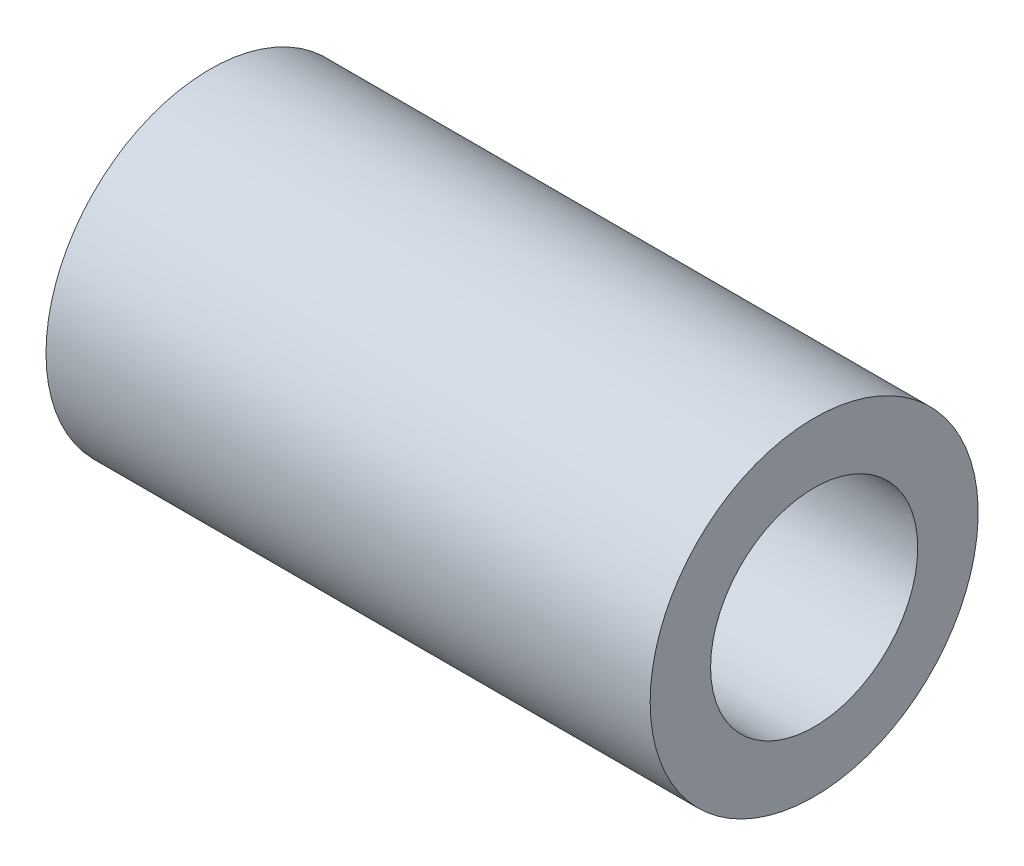
ISO-10303-21;
HEADER;
FILE_DESCRIPTION(('STEP AP214'),'2;1');
FILE_NAME('part.step','',(''),(''),'','','');
FILE_SCHEMA(('AUTOMOTIVE_DESIGN { 1 0 10303 214 1 1 1 1 }'));
ENDSEC;
DATA;
#1=APPLICATION_CONTEXT('core data for automotive mechanical design processes');
#2=APPLICATION_PROTOCOL_DEFINITION('international standard','automotive_design',2000,#1);
#3=PRODUCT_CONTEXT('',#1,'mechanical');
#4=PRODUCT('Part','Part','',(#3));
#5=PRODUCT_RELATED_PRODUCT_CATEGORY('part','',(#4));
#6=PRODUCT_DEFINITION_FORMATION('','',#4);
#7=PRODUCT_DEFINITION_CONTEXT('part definition',#1,'design');
#8=PRODUCT_DEFINITION('design','',#6,#7);
#9=PRODUCT_DEFINITION_SHAPE('','',#8);
#10=(LENGTH_UNIT() NAMED_UNIT(*) SI_UNIT(.MILLI.,.METRE.));
#11=(NAMED_UNIT(*) PLANE_ANGLE_UNIT() SI_UNIT($,.RADIAN.));
#12=(NAMED_UNIT(*) SI_UNIT($,.STERADIAN.) SOLID_ANGLE_UNIT());
#13=UNCERTAINTY_MEASURE_WITH_UNIT(LENGTH_MEASURE(1.E-05),#10,'distance_accuracy_value','');
#14=(GEOMETRIC_REPRESENTATION_CONTEXT(3) GLOBAL_UNCERTAINTY_ASSIGNED_CONTEXT((#13)) GLOBAL_UNIT_ASSIGNED_CONTEXT((#10,
#11,#12)) REPRESENTATION_CONTEXT('',''));
#15=CARTESIAN_POINT('',(0.,0.,0.));
#16=DIRECTION('',(0.,0.,1.));
#17=DIRECTION('',(1.,0.,0.));
#18=AXIS2_PLACEMENT_3D('',#15,#16,#17);
#19=CARTESIAN_POINT('',(0.,15.08125,0.));
#20=DIRECTION('',(1.,0.,0.));
#21=DIRECTION('',(0.,0.,-1.));
#22=AXIS2_PLACEMENT_3D('',#19,#20,#21);
#23=PLANE('',#22);
#24=CARTESIAN_POINT('',(0.,0.,0.));
#25=DIRECTION('',(-1.,0.,0.));
#26=DIRECTION('',(0.,0.,1.));
#27=AXIS2_PLACEMENT_3D('',#24,#25,#26);
#28=CIRCLE('',#27,9.525);
#29=CARTESIAN_POINT('',(0.,0.,9.525));
#30=VERTEX_POINT('',#29);
#31=EDGE_CURVE('E10',#30,#30,#28,.T.);
#32=ORIENTED_EDGE('',*,*,#31,.F.);
#33=EDGE_LOOP('',(#32));
#34=FACE_BOUND('',#33,.T.);
#35=CARTESIAN_POINT('',(0.,0.,0.));
#36=DIRECTION('',(-1.,0.,0.));
#37=DIRECTION('',(0.,0.,1.));
#38=AXIS2_PLACEMENT_3D('',#35,#36,#37);
#39=CIRCLE('',#38,15.08125);
#40=CARTESIAN_POINT('',(0.,0.,15.08125));
#41=VERTEX_POINT('',#40);
#42=EDGE_CURVE('E45',#41,#41,#39,.T.);
#43=ORIENTED_EDGE('',*,*,#42,.T.);
#44=EDGE_LOOP('',(#43));
#45=FACE_BOUND('',#44,.T.);
#46=ADVANCED_FACE('F31',(#34,#45),#23,.F.);
#47=CARTESIAN_POINT('',(55.5625,0.,0.));
#48=DIRECTION('',(-1.,0.,0.));
#49=DIRECTION('',(0.,0.,1.));
#50=AXIS2_PLACEMENT_3D('',#47,#48,#49);
#51=CYLINDRICAL_SURFACE('',#50,9.525);
#52=CARTESIAN_POINT('',(55.5625,0.,0.));
#53=DIRECTION('',(-1.,0.,0.));
#54=DIRECTION('',(0.,0.,1.));
#55=AXIS2_PLACEMENT_3D('',#52,#53,#54);
#56=CIRCLE('',#55,9.525);
#57=CARTESIAN_POINT('',(55.5625,0.,9.525));
#58=VERTEX_POINT('',#57);
#59=EDGE_CURVE('E37',#58,#58,#56,.T.);
#60=ORIENTED_EDGE('',*,*,#59,.F.);
#61=EDGE_LOOP('',(#60));
#62=FACE_BOUND('',#61,.T.);
#63=ORIENTED_EDGE('',*,*,#31,.T.);
#64=EDGE_LOOP('',(#63));
#65=FACE_BOUND('',#64,.T.);
#66=ADVANCED_FACE('F60',(#62,#65),#51,.F.);
#67=CARTESIAN_POINT('',(55.5625,9.525,0.));
#68=DIRECTION('',(-1.,0.,0.));
#69=DIRECTION('',(0.,0.,1.));
#70=AXIS2_PLACEMENT_3D('',#67,#68,#69);
#71=PLANE('',#70);
#72=CARTESIAN_POINT('',(55.5625,0.,0.));
#73=DIRECTION('',(-1.,0.,0.));
#74=DIRECTION('',(0.,0.,1.));
#75=AXIS2_PLACEMENT_3D('',#72,#73,#74);
#76=CIRCLE('',#75,15.08125);
#77=CARTESIAN_POINT('',(55.5625,0.,15.08125));
#78=VERTEX_POINT('',#77);
#79=EDGE_CURVE('E41',#78,#78,#76,.T.);
#80=ORIENTED_EDGE('',*,*,#79,.F.);
#81=EDGE_LOOP('',(#80));
#82=FACE_BOUND('',#81,.T.);
#83=ORIENTED_EDGE('',*,*,#59,.T.);
#84=EDGE_LOOP('',(#83));
#85=FACE_BOUND('',#84,.T.);
#86=ADVANCED_FACE('F55',(#82,#85),#71,.F.);
#87=CARTESIAN_POINT('',(55.5625,0.,0.));
#88=DIRECTION('',(-1.,0.,0.));
#89=DIRECTION('',(0.,0.,1.));
#90=AXIS2_PLACEMENT_3D('',#87,#88,#89);
#91=CYLINDRICAL_SURFACE('',#90,15.08125);
#92=ORIENTED_EDGE('',*,*,#42,.F.);
#93=EDGE_LOOP('',(#92));
#94=FACE_BOUND('',#93,.T.);
#95=ORIENTED_EDGE('',*,*,#79,.T.);
#96=EDGE_LOOP('',(#95));
#97=FACE_BOUND('',#96,.T.);
#98=ADVANCED_FACE('F52',(#94,#97),#91,.T.);
#99=CLOSED_SHELL('',(#46,#66,#86,#98));
#100=MANIFOLD_SOLID_BREP('B2',#99);
#101=ADVANCED_BREP_SHAPE_REPRESENTATION('',(#18,#100),#14);
#102=SHAPE_DEFINITION_REPRESENTATION(#9,#101);
ENDSEC;
END-ISO-10303-21;
